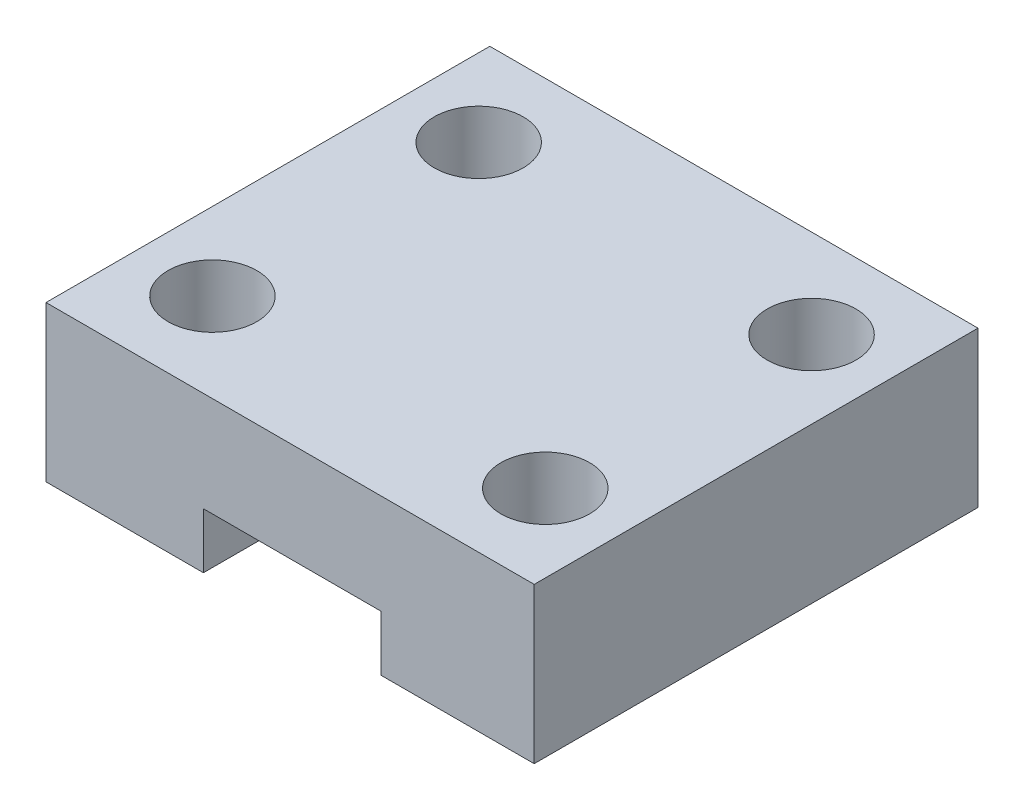
ISO-10303-21;
HEADER;
FILE_DESCRIPTION(('STEP AP214'),'2;1');
FILE_NAME('part.step','',(''),(''),'','','');
FILE_SCHEMA(('AUTOMOTIVE_DESIGN { 1 0 10303 214 1 1 1 1 }'));
ENDSEC;
DATA;
#1=APPLICATION_CONTEXT('core data for automotive mechanical design processes');
#2=APPLICATION_PROTOCOL_DEFINITION('international standard','automotive_design',2000,#1);
#3=PRODUCT_CONTEXT('',#1,'mechanical');
#4=PRODUCT('Part','Part','',(#3));
#5=PRODUCT_RELATED_PRODUCT_CATEGORY('part','',(#4));
#6=PRODUCT_DEFINITION_FORMATION('','',#4);
#7=PRODUCT_DEFINITION_CONTEXT('part definition',#1,'design');
#8=PRODUCT_DEFINITION('design','',#6,#7);
#9=PRODUCT_DEFINITION_SHAPE('','',#8);
#10=(LENGTH_UNIT() NAMED_UNIT(*) SI_UNIT(.MILLI.,.METRE.));
#11=(NAMED_UNIT(*) PLANE_ANGLE_UNIT() SI_UNIT($,.RADIAN.));
#12=(NAMED_UNIT(*) SI_UNIT($,.STERADIAN.) SOLID_ANGLE_UNIT());
#13=UNCERTAINTY_MEASURE_WITH_UNIT(LENGTH_MEASURE(1.E-05),#10,'distance_accuracy_value','');
#14=(GEOMETRIC_REPRESENTATION_CONTEXT(3) GLOBAL_UNCERTAINTY_ASSIGNED_CONTEXT((#13)) GLOBAL_UNIT_ASSIGNED_CONTEXT((#10,
#11,#12)) REPRESENTATION_CONTEXT('',''));
#15=CARTESIAN_POINT('',(0.,0.,0.));
#16=DIRECTION('',(0.,0.,1.));
#17=DIRECTION('',(1.,0.,0.));
#18=AXIS2_PLACEMENT_3D('',#15,#16,#17);
#19=CARTESIAN_POINT('',(0.,0.,0.));
#20=DIRECTION('',(0.,1.,0.));
#21=DIRECTION('',(0.,0.,1.));
#22=AXIS2_PLACEMENT_3D('',#19,#20,#21);
#23=PLANE('',#22);
#24=CARTESIAN_POINT('',(-15.1889361105186,0.,8.44236692807907));
#25=DIRECTION('',(0.,1.,0.));
#26=DIRECTION('',(0.,0.,1.));
#27=AXIS2_PLACEMENT_3D('',#24,#25,#26);
#28=CIRCLE('',#27,4.);
#29=CARTESIAN_POINT('',(-15.1889361105186,0.,12.4423669280791));
#30=VERTEX_POINT('',#29);
#31=EDGE_CURVE('E150',#30,#30,#28,.T.);
#32=ORIENTED_EDGE('',*,*,#31,.T.);
#33=EDGE_LOOP('',(#32));
#34=FACE_BOUND('',#33,.T.);
#35=CARTESIAN_POINT('',(-15.1889361105186,0.,-15.5576330719209));
#36=DIRECTION('',(0.,1.,0.));
#37=DIRECTION('',(0.,0.,1.));
#38=AXIS2_PLACEMENT_3D('',#35,#36,#37);
#39=CIRCLE('',#38,4.);
#40=CARTESIAN_POINT('',(-15.1889361105186,0.,-11.5576330719209));
#41=VERTEX_POINT('',#40);
#42=EDGE_CURVE('E156',#41,#41,#39,.T.);
#43=ORIENTED_EDGE('',*,*,#42,.T.);
#44=EDGE_LOOP('',(#43));
#45=FACE_BOUND('',#44,.T.);
#46=DIRECTION('',(0.,0.,-1.));
#47=VECTOR('',#46,1.);
#48=CARTESIAN_POINT('',(-8.,0.,0.));
#49=LINE('',#48,#47);
#50=CARTESIAN_POINT('',(-8.,0.,16.4423669280791));
#51=VERTEX_POINT('',#50);
#52=CARTESIAN_POINT('',(-8.,0.,-23.5576330719209));
#53=VERTEX_POINT('',#52);
#54=EDGE_CURVE('E123',#51,#53,#49,.T.);
#55=ORIENTED_EDGE('',*,*,#54,.F.);
#56=DIRECTION('',(1.,0.,0.));
#57=VECTOR('',#56,1.);
#58=CARTESIAN_POINT('',(-22.1889361105186,0.,16.4423669280791));
#59=LINE('',#58,#57);
#60=CARTESIAN_POINT('',(-22.1889361105186,0.,16.4423669280791));
#61=VERTEX_POINT('',#60);
#62=EDGE_CURVE('E217',#61,#51,#59,.T.);
#63=ORIENTED_EDGE('',*,*,#62,.F.);
#64=DIRECTION('',(0.,0.,1.));
#65=VECTOR('',#64,1.);
#66=CARTESIAN_POINT('',(-22.1889361105186,0.,-23.5576330719209));
#67=LINE('',#66,#65);
#68=CARTESIAN_POINT('',(-22.1889361105186,0.,-23.5576330719209));
#69=VERTEX_POINT('',#68);
#70=EDGE_CURVE('E215',#69,#61,#67,.T.);
#71=ORIENTED_EDGE('',*,*,#70,.F.);
#72=DIRECTION('',(-1.,0.,0.));
#73=VECTOR('',#72,1.);
#74=CARTESIAN_POINT('',(-22.1889361105186,0.,-23.5576330719209));
#75=LINE('',#74,#73);
#76=EDGE_CURVE('E211',#53,#69,#75,.T.);
#77=ORIENTED_EDGE('',*,*,#76,.F.);
#78=EDGE_LOOP('',(#55,#63,#71,#77));
#79=FACE_BOUND('',#78,.T.);
#80=ADVANCED_FACE('F43',(#34,#45,#79),#23,.F.);
#81=CARTESIAN_POINT('',(14.8110638894814,0.,-15.5576330719209));
#82=DIRECTION('',(0.,1.,0.));
#83=DIRECTION('',(0.,0.,1.));
#84=AXIS2_PLACEMENT_3D('',#81,#82,#83);
#85=CIRCLE('',#84,4.);
#86=CARTESIAN_POINT('',(14.8110638894814,0.,-11.5576330719209));
#87=VERTEX_POINT('',#86);
#88=EDGE_CURVE('E180',#87,#87,#85,.T.);
#89=ORIENTED_EDGE('',*,*,#88,.T.);
#90=EDGE_LOOP('',(#89));
#91=FACE_BOUND('',#90,.T.);
#92=CARTESIAN_POINT('',(14.8110638894814,0.,8.44236692807907));
#93=DIRECTION('',(0.,1.,0.));
#94=DIRECTION('',(0.,0.,1.));
#95=AXIS2_PLACEMENT_3D('',#92,#93,#94);
#96=CIRCLE('',#95,4.);
#97=CARTESIAN_POINT('',(14.8110638894814,0.,12.4423669280791));
#98=VERTEX_POINT('',#97);
#99=EDGE_CURVE('E274',#98,#98,#96,.T.);
#100=ORIENTED_EDGE('',*,*,#99,.T.);
#101=EDGE_LOOP('',(#100));
#102=FACE_BOUND('',#101,.T.);
#103=DIRECTION('',(0.,0.,1.));
#104=VECTOR('',#103,1.);
#105=CARTESIAN_POINT('',(8.,0.,0.));
#106=LINE('',#105,#104);
#107=CARTESIAN_POINT('',(8.,0.,-23.5576330719209));
#108=VERTEX_POINT('',#107);
#109=CARTESIAN_POINT('',(8.,0.,16.4423669280791));
#110=VERTEX_POINT('',#109);
#111=EDGE_CURVE('E59',#108,#110,#106,.T.);
#112=ORIENTED_EDGE('',*,*,#111,.F.);
#113=CARTESIAN_POINT('',(21.8110638894814,0.,-23.5576330719209));
#114=VERTEX_POINT('',#113);
#115=EDGE_CURVE('E213',#114,#108,#75,.T.);
#116=ORIENTED_EDGE('',*,*,#115,.F.);
#117=DIRECTION('',(0.,0.,-1.));
#118=VECTOR('',#117,1.);
#119=CARTESIAN_POINT('',(21.8110638894814,0.,-23.5576330719209));
#120=LINE('',#119,#118);
#121=CARTESIAN_POINT('',(21.8110638894814,0.,16.4423669280791));
#122=VERTEX_POINT('',#121);
#123=EDGE_CURVE('E207',#122,#114,#120,.T.);
#124=ORIENTED_EDGE('',*,*,#123,.F.);
#125=EDGE_CURVE('E88',#110,#122,#59,.T.);
#126=ORIENTED_EDGE('',*,*,#125,.F.);
#127=EDGE_LOOP('',(#112,#116,#124,#126));
#128=FACE_BOUND('',#127,.T.);
#129=ADVANCED_FACE('F231',(#91,#102,#128),#23,.F.);
#130=CARTESIAN_POINT('',(-22.1889361105186,14.,-23.5576330719209));
#131=DIRECTION('',(0.,0.,1.));
#132=DIRECTION('',(1.,0.,0.));
#133=AXIS2_PLACEMENT_3D('',#130,#131,#132);
#134=PLANE('',#133);
#135=DIRECTION('',(0.,1.,0.));
#136=VECTOR('',#135,1.);
#137=CARTESIAN_POINT('',(-8.,5.,-23.5576330719209));
#138=LINE('',#137,#136);
#139=CARTESIAN_POINT('',(-8.,5.,-23.5576330719209));
#140=VERTEX_POINT('',#139);
#141=EDGE_CURVE('E117',#53,#140,#138,.T.);
#142=ORIENTED_EDGE('',*,*,#141,.F.);
#143=ORIENTED_EDGE('',*,*,#76,.T.);
#144=DIRECTION('',(0.,-1.,0.));
#145=VECTOR('',#144,1.);
#146=CARTESIAN_POINT('',(-22.1889361105186,14.,-23.5576330719209));
#147=LINE('',#146,#145);
#148=CARTESIAN_POINT('',(-22.1889361105186,14.,-23.5576330719209));
#149=VERTEX_POINT('',#148);
#150=EDGE_CURVE('E224',#149,#69,#147,.T.);
#151=ORIENTED_EDGE('',*,*,#150,.F.);
#152=DIRECTION('',(-1.,0.,0.));
#153=VECTOR('',#152,1.);
#154=CARTESIAN_POINT('',(-22.1889361105186,14.,-23.5576330719209));
#155=LINE('',#154,#153);
#156=CARTESIAN_POINT('',(21.8110638894814,14.,-23.5576330719209));
#157=VERTEX_POINT('',#156);
#158=EDGE_CURVE('E96',#157,#149,#155,.T.);
#159=ORIENTED_EDGE('',*,*,#158,.F.);
#160=DIRECTION('',(0.,-1.,0.));
#161=VECTOR('',#160,1.);
#162=CARTESIAN_POINT('',(21.8110638894814,14.,-23.5576330719209));
#163=LINE('',#162,#161);
#164=EDGE_CURVE('E52',#157,#114,#163,.T.);
#165=ORIENTED_EDGE('',*,*,#164,.T.);
#166=ORIENTED_EDGE('',*,*,#115,.T.);
#167=DIRECTION('',(0.,-1.,0.));
#168=VECTOR('',#167,1.);
#169=CARTESIAN_POINT('',(8.,5.,-23.5576330719209));
#170=LINE('',#169,#168);
#171=CARTESIAN_POINT('',(8.,5.,-23.5576330719209));
#172=VERTEX_POINT('',#171);
#173=EDGE_CURVE('E127',#172,#108,#170,.T.);
#174=ORIENTED_EDGE('',*,*,#173,.F.);
#175=DIRECTION('',(1.,0.,0.));
#176=VECTOR('',#175,1.);
#177=CARTESIAN_POINT('',(-8.,5.,-23.5576330719209));
#178=LINE('',#177,#176);
#179=EDGE_CURVE('E133',#140,#172,#178,.T.);
#180=ORIENTED_EDGE('',*,*,#179,.F.);
#181=EDGE_LOOP('',(#142,#143,#151,#159,#165,#166,#174,#180));
#182=FACE_BOUND('',#181,.T.);
#183=ADVANCED_FACE('F139',(#182),#134,.F.);
#184=CARTESIAN_POINT('',(-22.1889361105186,14.,16.4423669280791));
#185=DIRECTION('',(0.,0.,-1.));
#186=DIRECTION('',(-1.,0.,0.));
#187=AXIS2_PLACEMENT_3D('',#184,#185,#186);
#188=PLANE('',#187);
#189=DIRECTION('',(0.,-1.,0.));
#190=VECTOR('',#189,1.);
#191=CARTESIAN_POINT('',(-8.,14.,16.4423669280791));
#192=LINE('',#191,#190);
#193=CARTESIAN_POINT('',(-8.,5.,16.4423669280791));
#194=VERTEX_POINT('',#193);
#195=EDGE_CURVE('E12',#194,#51,#192,.T.);
#196=ORIENTED_EDGE('',*,*,#195,.F.);
#197=DIRECTION('',(1.,0.,0.));
#198=VECTOR('',#197,1.);
#199=CARTESIAN_POINT('',(-8.,5.,16.4423669280791));
#200=LINE('',#199,#198);
#201=CARTESIAN_POINT('',(8.,5.,16.4423669280791));
#202=VERTEX_POINT('',#201);
#203=EDGE_CURVE('E136',#194,#202,#200,.T.);
#204=ORIENTED_EDGE('',*,*,#203,.T.);
#205=DIRECTION('',(0.,-1.,0.));
#206=VECTOR('',#205,1.);
#207=CARTESIAN_POINT('',(8.,5.,16.4423669280791));
#208=LINE('',#207,#206);
#209=EDGE_CURVE('E145',#202,#110,#208,.T.);
#210=ORIENTED_EDGE('',*,*,#209,.T.);
#211=ORIENTED_EDGE('',*,*,#125,.T.);
#212=DIRECTION('',(0.,-1.,0.));
#213=VECTOR('',#212,1.);
#214=CARTESIAN_POINT('',(21.8110638894814,14.,16.4423669280791));
#215=LINE('',#214,#213);
#216=CARTESIAN_POINT('',(21.8110638894814,14.,16.4423669280791));
#217=VERTEX_POINT('',#216);
#218=EDGE_CURVE('E206',#217,#122,#215,.T.);
#219=ORIENTED_EDGE('',*,*,#218,.F.);
#220=DIRECTION('',(1.,0.,0.));
#221=VECTOR('',#220,1.);
#222=CARTESIAN_POINT('',(-22.1889361105186,14.,16.4423669280791));
#223=LINE('',#222,#221);
#224=CARTESIAN_POINT('',(-22.1889361105186,14.,16.4423669280791));
#225=VERTEX_POINT('',#224);
#226=EDGE_CURVE('E68',#225,#217,#223,.T.);
#227=ORIENTED_EDGE('',*,*,#226,.F.);
#228=DIRECTION('',(0.,-1.,0.));
#229=VECTOR('',#228,1.);
#230=CARTESIAN_POINT('',(-22.1889361105186,14.,16.4423669280791));
#231=LINE('',#230,#229);
#232=EDGE_CURVE('E221',#225,#61,#231,.T.);
#233=ORIENTED_EDGE('',*,*,#232,.T.);
#234=ORIENTED_EDGE('',*,*,#62,.T.);
#235=EDGE_LOOP('',(#196,#204,#210,#211,#219,#227,#233,#234));
#236=FACE_BOUND('',#235,.T.);
#237=ADVANCED_FACE('F239',(#236),#188,.F.);
#238=CARTESIAN_POINT('',(0.,14.,0.));
#239=DIRECTION('',(0.,1.,0.));
#240=DIRECTION('',(0.,0.,1.));
#241=AXIS2_PLACEMENT_3D('',#238,#239,#240);
#242=PLANE('',#241);
#243=CARTESIAN_POINT('',(-15.1889361105186,14.,-15.5576330719209));
#244=DIRECTION('',(0.,1.,0.));
#245=DIRECTION('',(0.,0.,1.));
#246=AXIS2_PLACEMENT_3D('',#243,#244,#245);
#247=CIRCLE('',#246,4.);
#248=CARTESIAN_POINT('',(-15.1889361105186,14.,-11.5576330719209));
#249=VERTEX_POINT('',#248);
#250=EDGE_CURVE('E175',#249,#249,#247,.T.);
#251=ORIENTED_EDGE('',*,*,#250,.F.);
#252=EDGE_LOOP('',(#251));
#253=FACE_BOUND('',#252,.T.);
#254=CARTESIAN_POINT('',(14.8110638894814,14.,8.44236692807907));
#255=DIRECTION('',(0.,1.,0.));
#256=DIRECTION('',(0.,0.,1.));
#257=AXIS2_PLACEMENT_3D('',#254,#255,#256);
#258=CIRCLE('',#257,4.);
#259=CARTESIAN_POINT('',(14.8110638894814,14.,12.4423669280791));
#260=VERTEX_POINT('',#259);
#261=EDGE_CURVE('E212',#260,#260,#258,.T.);
#262=ORIENTED_EDGE('',*,*,#261,.F.);
#263=EDGE_LOOP('',(#262));
#264=FACE_BOUND('',#263,.T.);
#265=DIRECTION('',(0.,0.,-1.));
#266=VECTOR('',#265,1.);
#267=CARTESIAN_POINT('',(21.8110638894814,14.,-23.5576330719209));
#268=LINE('',#267,#266);
#269=EDGE_CURVE('E196',#217,#157,#268,.T.);
#270=ORIENTED_EDGE('',*,*,#269,.T.);
#271=ORIENTED_EDGE('',*,*,#158,.T.);
#272=DIRECTION('',(0.,0.,1.));
#273=VECTOR('',#272,1.);
#274=CARTESIAN_POINT('',(-22.1889361105186,14.,-23.5576330719209));
#275=LINE('',#274,#273);
#276=EDGE_CURVE('E195',#149,#225,#275,.T.);
#277=ORIENTED_EDGE('',*,*,#276,.T.);
#278=ORIENTED_EDGE('',*,*,#226,.T.);
#279=EDGE_LOOP('',(#270,#271,#277,#278));
#280=FACE_BOUND('',#279,.T.);
#281=CARTESIAN_POINT('',(14.8110638894814,14.,-15.5576330719209));
#282=DIRECTION('',(0.,1.,0.));
#283=DIRECTION('',(0.,0.,1.));
#284=AXIS2_PLACEMENT_3D('',#281,#282,#283);
#285=CIRCLE('',#284,4.);
#286=CARTESIAN_POINT('',(14.8110638894814,14.,-11.5576330719209));
#287=VERTEX_POINT('',#286);
#288=EDGE_CURVE('E277',#287,#287,#285,.T.);
#289=ORIENTED_EDGE('',*,*,#288,.F.);
#290=EDGE_LOOP('',(#289));
#291=FACE_BOUND('',#290,.T.);
#292=CARTESIAN_POINT('',(-15.1889361105186,14.,8.44236692807907));
#293=DIRECTION('',(0.,1.,0.));
#294=DIRECTION('',(0.,0.,1.));
#295=AXIS2_PLACEMENT_3D('',#292,#293,#294);
#296=CIRCLE('',#295,4.);
#297=CARTESIAN_POINT('',(-15.1889361105186,14.,12.4423669280791));
#298=VERTEX_POINT('',#297);
#299=EDGE_CURVE('E151',#298,#298,#296,.T.);
#300=ORIENTED_EDGE('',*,*,#299,.F.);
#301=EDGE_LOOP('',(#300));
#302=FACE_BOUND('',#301,.T.);
#303=ADVANCED_FACE('F245',(#253,#264,#280,#291,#302),#242,.T.);
#304=CARTESIAN_POINT('',(21.8110638894814,14.,-23.5576330719209));
#305=DIRECTION('',(-1.,0.,0.));
#306=DIRECTION('',(0.,0.,1.));
#307=AXIS2_PLACEMENT_3D('',#304,#305,#306);
#308=PLANE('',#307);
#309=ORIENTED_EDGE('',*,*,#123,.T.);
#310=ORIENTED_EDGE('',*,*,#164,.F.);
#311=ORIENTED_EDGE('',*,*,#269,.F.);
#312=ORIENTED_EDGE('',*,*,#218,.T.);
#313=EDGE_LOOP('',(#309,#310,#311,#312));
#314=FACE_BOUND('',#313,.T.);
#315=ADVANCED_FACE('F45',(#314),#308,.F.);
#316=CARTESIAN_POINT('',(-22.1889361105186,14.,-23.5576330719209));
#317=DIRECTION('',(1.,0.,0.));
#318=DIRECTION('',(0.,0.,-1.));
#319=AXIS2_PLACEMENT_3D('',#316,#317,#318);
#320=PLANE('',#319);
#321=ORIENTED_EDGE('',*,*,#70,.T.);
#322=ORIENTED_EDGE('',*,*,#232,.F.);
#323=ORIENTED_EDGE('',*,*,#276,.F.);
#324=ORIENTED_EDGE('',*,*,#150,.T.);
#325=EDGE_LOOP('',(#321,#322,#323,#324));
#326=FACE_BOUND('',#325,.T.);
#327=ADVANCED_FACE('F249',(#326),#320,.F.);
#328=CARTESIAN_POINT('',(14.8110638894814,14.,8.44236692807907));
#329=DIRECTION('',(0.,-1.,0.));
#330=DIRECTION('',(0.,0.,-1.));
#331=AXIS2_PLACEMENT_3D('',#328,#329,#330);
#332=CYLINDRICAL_SURFACE('',#331,4.);
#333=ORIENTED_EDGE('',*,*,#261,.T.);
#334=EDGE_LOOP('',(#333));
#335=FACE_BOUND('',#334,.T.);
#336=ORIENTED_EDGE('',*,*,#99,.F.);
#337=EDGE_LOOP('',(#336));
#338=FACE_BOUND('',#337,.T.);
#339=ADVANCED_FACE('F251',(#335,#338),#332,.F.);
#340=CARTESIAN_POINT('',(14.8110638894814,14.,-15.5576330719209));
#341=DIRECTION('',(0.,-1.,0.));
#342=DIRECTION('',(0.,0.,-1.));
#343=AXIS2_PLACEMENT_3D('',#340,#341,#342);
#344=CYLINDRICAL_SURFACE('',#343,4.);
#345=ORIENTED_EDGE('',*,*,#288,.T.);
#346=EDGE_LOOP('',(#345));
#347=FACE_BOUND('',#346,.T.);
#348=ORIENTED_EDGE('',*,*,#88,.F.);
#349=EDGE_LOOP('',(#348));
#350=FACE_BOUND('',#349,.T.);
#351=ADVANCED_FACE('F257',(#347,#350),#344,.F.);
#352=CARTESIAN_POINT('',(-15.1889361105186,14.,-15.5576330719209));
#353=DIRECTION('',(0.,-1.,0.));
#354=DIRECTION('',(0.,0.,-1.));
#355=AXIS2_PLACEMENT_3D('',#352,#353,#354);
#356=CYLINDRICAL_SURFACE('',#355,4.);
#357=ORIENTED_EDGE('',*,*,#250,.T.);
#358=EDGE_LOOP('',(#357));
#359=FACE_BOUND('',#358,.T.);
#360=ORIENTED_EDGE('',*,*,#42,.F.);
#361=EDGE_LOOP('',(#360));
#362=FACE_BOUND('',#361,.T.);
#363=ADVANCED_FACE('F298',(#359,#362),#356,.F.);
#364=CARTESIAN_POINT('',(-15.1889361105186,14.,8.44236692807907));
#365=DIRECTION('',(0.,-1.,0.));
#366=DIRECTION('',(0.,0.,-1.));
#367=AXIS2_PLACEMENT_3D('',#364,#365,#366);
#368=CYLINDRICAL_SURFACE('',#367,4.);
#369=ORIENTED_EDGE('',*,*,#299,.T.);
#370=EDGE_LOOP('',(#369));
#371=FACE_BOUND('',#370,.T.);
#372=ORIENTED_EDGE('',*,*,#31,.F.);
#373=EDGE_LOOP('',(#372));
#374=FACE_BOUND('',#373,.T.);
#375=ADVANCED_FACE('F304',(#371,#374),#368,.F.);
#376=CARTESIAN_POINT('',(-8.,5.,33.9529964789488));
#377=DIRECTION('',(1.,0.,0.));
#378=DIRECTION('',(0.,0.,-1.));
#379=AXIS2_PLACEMENT_3D('',#376,#377,#378);
#380=PLANE('',#379);
#381=ORIENTED_EDGE('',*,*,#54,.T.);
#382=ORIENTED_EDGE('',*,*,#141,.T.);
#383=DIRECTION('',(0.,0.,-1.));
#384=VECTOR('',#383,1.);
#385=CARTESIAN_POINT('',(-8.,5.,33.9529964789488));
#386=LINE('',#385,#384);
#387=EDGE_CURVE('E120',#194,#140,#386,.T.);
#388=ORIENTED_EDGE('',*,*,#387,.F.);
#389=ORIENTED_EDGE('',*,*,#195,.T.);
#390=EDGE_LOOP('',(#381,#382,#388,#389));
#391=FACE_BOUND('',#390,.T.);
#392=ADVANCED_FACE('F119',(#391),#380,.T.);
#393=CARTESIAN_POINT('',(8.,5.,33.9529964789488));
#394=DIRECTION('',(-1.,0.,0.));
#395=DIRECTION('',(0.,0.,1.));
#396=AXIS2_PLACEMENT_3D('',#393,#394,#395);
#397=PLANE('',#396);
#398=ORIENTED_EDGE('',*,*,#111,.T.);
#399=ORIENTED_EDGE('',*,*,#209,.F.);
#400=DIRECTION('',(0.,0.,-1.));
#401=VECTOR('',#400,1.);
#402=CARTESIAN_POINT('',(8.,5.,33.9529964789488));
#403=LINE('',#402,#401);
#404=EDGE_CURVE('E137',#202,#172,#403,.T.);
#405=ORIENTED_EDGE('',*,*,#404,.T.);
#406=ORIENTED_EDGE('',*,*,#173,.T.);
#407=EDGE_LOOP('',(#398,#399,#405,#406));
#408=FACE_BOUND('',#407,.T.);
#409=ADVANCED_FACE('F311',(#408),#397,.T.);
#410=CARTESIAN_POINT('',(-8.,5.,33.9529964789488));
#411=DIRECTION('',(0.,-1.,0.));
#412=DIRECTION('',(0.,0.,-1.));
#413=AXIS2_PLACEMENT_3D('',#410,#411,#412);
#414=PLANE('',#413);
#415=ORIENTED_EDGE('',*,*,#387,.T.);
#416=ORIENTED_EDGE('',*,*,#179,.T.);
#417=ORIENTED_EDGE('',*,*,#404,.F.);
#418=ORIENTED_EDGE('',*,*,#203,.F.);
#419=EDGE_LOOP('',(#415,#416,#417,#418));
#420=FACE_BOUND('',#419,.T.);
#421=ADVANCED_FACE('F131',(#420),#414,.T.);
#422=CLOSED_SHELL('',(#80,#129,#183,#237,#303,#315,#327,#339,#351,#363,#375,#392,#409,#421));
#423=MANIFOLD_SOLID_BREP('B2',#422);
#424=ADVANCED_BREP_SHAPE_REPRESENTATION('',(#18,#423),#14);
#425=SHAPE_DEFINITION_REPRESENTATION(#9,#424);
ENDSEC;
END-ISO-10303-21;
